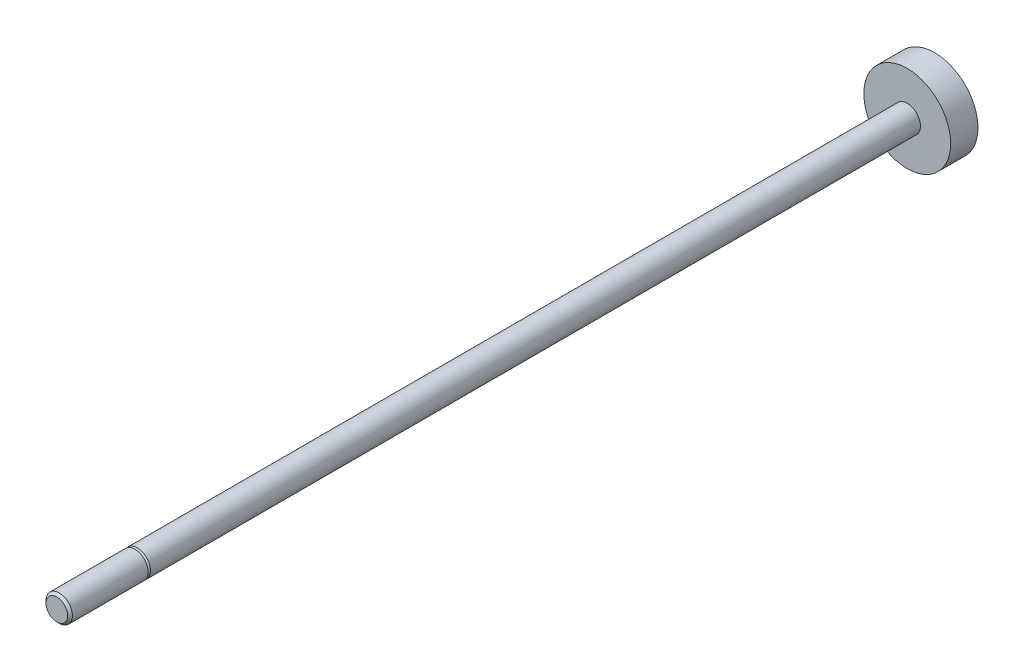
ISO-10303-21;
HEADER;
FILE_DESCRIPTION(('STEP AP214'),'2;1');
FILE_NAME('part.step','',(''),(''),'','','');
FILE_SCHEMA(('AUTOMOTIVE_DESIGN { 1 0 10303 214 1 1 1 1 }'));
ENDSEC;
DATA;
#1=APPLICATION_CONTEXT('core data for automotive mechanical design processes');
#2=APPLICATION_PROTOCOL_DEFINITION('international standard','automotive_design',2000,#1);
#3=PRODUCT_CONTEXT('',#1,'mechanical');
#4=PRODUCT('Part','Part','',(#3));
#5=PRODUCT_RELATED_PRODUCT_CATEGORY('part','',(#4));
#6=PRODUCT_DEFINITION_FORMATION('','',#4);
#7=PRODUCT_DEFINITION_CONTEXT('part definition',#1,'design');
#8=PRODUCT_DEFINITION('design','',#6,#7);
#9=PRODUCT_DEFINITION_SHAPE('','',#8);
#10=(LENGTH_UNIT() NAMED_UNIT(*) SI_UNIT(.MILLI.,.METRE.));
#11=(NAMED_UNIT(*) PLANE_ANGLE_UNIT() SI_UNIT($,.RADIAN.));
#12=(NAMED_UNIT(*) SI_UNIT($,.STERADIAN.) SOLID_ANGLE_UNIT());
#13=UNCERTAINTY_MEASURE_WITH_UNIT(LENGTH_MEASURE(1.E-05),#10,'distance_accuracy_value','');
#14=(GEOMETRIC_REPRESENTATION_CONTEXT(3) GLOBAL_UNCERTAINTY_ASSIGNED_CONTEXT((#13)) GLOBAL_UNIT_ASSIGNED_CONTEXT((#10,
#11,#12)) REPRESENTATION_CONTEXT('',''));
#15=CARTESIAN_POINT('',(0.,0.,0.));
#16=DIRECTION('',(0.,0.,1.));
#17=DIRECTION('',(1.,0.,0.));
#18=AXIS2_PLACEMENT_3D('',#15,#16,#17);
#19=CARTESIAN_POINT('',(0.,0.,25.4));
#20=DIRECTION('',(0.,0.,1.));
#21=DIRECTION('',(1.,0.,0.));
#22=AXIS2_PLACEMENT_3D('',#19,#20,#21);
#23=PLANE('',#22);
#24=CARTESIAN_POINT('',(0.,0.,25.4));
#25=DIRECTION('',(0.,0.,1.));
#26=DIRECTION('',(1.,0.,0.));
#27=AXIS2_PLACEMENT_3D('',#24,#25,#26);
#28=CIRCLE('',#27,1.9812);
#29=CARTESIAN_POINT('',(1.9812,0.,25.4));
#30=VERTEX_POINT('',#29);
#31=EDGE_CURVE('E55',#30,#30,#28,.T.);
#32=ORIENTED_EDGE('',*,*,#31,.T.);
#33=EDGE_LOOP('',(#32));
#34=FACE_BOUND('',#33,.T.);
#35=ADVANCED_FACE('F14',(#34),#23,.T.);
#36=CARTESIAN_POINT('',(0.,0.,-135.0499));
#37=DIRECTION('',(0.,0.,1.));
#38=DIRECTION('',(1.,0.,0.));
#39=AXIS2_PLACEMENT_3D('',#36,#37,#38);
#40=PLANE('',#39);
#41=CARTESIAN_POINT('',(0.,0.,-135.0499));
#42=DIRECTION('',(0.,0.,1.));
#43=DIRECTION('',(1.,0.,0.));
#44=AXIS2_PLACEMENT_3D('',#41,#42,#43);
#45=CIRCLE('',#44,7.9375);
#46=CARTESIAN_POINT('',(7.93750000000001,0.,-135.0499));
#47=VERTEX_POINT('',#46);
#48=EDGE_CURVE('E10',#47,#47,#45,.T.);
#49=ORIENTED_EDGE('',*,*,#48,.F.);
#50=EDGE_LOOP('',(#49));
#51=FACE_BOUND('',#50,.T.);
#52=ADVANCED_FACE('F76',(#51),#40,.F.);
#53=CARTESIAN_POINT('',(0.,0.,25.4));
#54=DIRECTION('',(0.,0.,1.));
#55=DIRECTION('',(1.,0.,0.));
#56=AXIS2_PLACEMENT_3D('',#53,#54,#55);
#57=CYLINDRICAL_SURFACE('',#56,7.9375);
#58=CARTESIAN_POINT('',(0.,0.,-130.0499));
#59=DIRECTION('',(0.,0.,1.));
#60=DIRECTION('',(1.,0.,0.));
#61=AXIS2_PLACEMENT_3D('',#58,#59,#60);
#62=CIRCLE('',#61,7.9375);
#63=CARTESIAN_POINT('',(7.93750000000001,0.,-130.0499));
#64=VERTEX_POINT('',#63);
#65=EDGE_CURVE('E21',#64,#64,#62,.T.);
#66=ORIENTED_EDGE('',*,*,#65,.F.);
#67=EDGE_LOOP('',(#66));
#68=FACE_BOUND('',#67,.T.);
#69=ORIENTED_EDGE('',*,*,#48,.T.);
#70=EDGE_LOOP('',(#69));
#71=FACE_BOUND('',#70,.T.);
#72=ADVANCED_FACE('F80',(#68,#71),#57,.T.);
#73=CARTESIAN_POINT('',(0.,7.9375,-130.0499));
#74=DIRECTION('',(0.,0.,-1.));
#75=DIRECTION('',(-1.,0.,0.));
#76=AXIS2_PLACEMENT_3D('',#73,#74,#75);
#77=PLANE('',#76);
#78=CARTESIAN_POINT('',(0.,0.,-130.0499));
#79=DIRECTION('',(0.,0.,1.));
#80=DIRECTION('',(1.,0.,0.));
#81=AXIS2_PLACEMENT_3D('',#78,#79,#80);
#82=CIRCLE('',#81,2.413);
#83=CARTESIAN_POINT('',(2.41300000000001,0.,-130.0499));
#84=VERTEX_POINT('',#83);
#85=EDGE_CURVE('E30',#84,#84,#82,.T.);
#86=ORIENTED_EDGE('',*,*,#85,.F.);
#87=EDGE_LOOP('',(#86));
#88=FACE_BOUND('',#87,.T.);
#89=ORIENTED_EDGE('',*,*,#65,.T.);
#90=EDGE_LOOP('',(#89));
#91=FACE_BOUND('',#90,.T.);
#92=ADVANCED_FACE('F85',(#88,#91),#77,.F.);
#93=CARTESIAN_POINT('',(0.,0.,25.4));
#94=DIRECTION('',(0.,0.,1.));
#95=DIRECTION('',(1.,0.,0.));
#96=AXIS2_PLACEMENT_3D('',#93,#94,#95);
#97=CYLINDRICAL_SURFACE('',#96,2.413);
#98=CARTESIAN_POINT('',(0.,0.,10.6934));
#99=DIRECTION('',(0.,0.,1.));
#100=DIRECTION('',(1.,0.,0.));
#101=AXIS2_PLACEMENT_3D('',#98,#99,#100);
#102=CIRCLE('',#101,2.413);
#103=CARTESIAN_POINT('',(2.413,0.,10.6934));
#104=VERTEX_POINT('',#103);
#105=EDGE_CURVE('E37',#104,#104,#102,.T.);
#106=ORIENTED_EDGE('',*,*,#105,.F.);
#107=EDGE_LOOP('',(#106));
#108=FACE_BOUND('',#107,.T.);
#109=ORIENTED_EDGE('',*,*,#85,.T.);
#110=EDGE_LOOP('',(#109));
#111=FACE_BOUND('',#110,.T.);
#112=ADVANCED_FACE('F91',(#108,#111),#97,.T.);
#113=CARTESIAN_POINT('',(0.,0.,11.1252));
#114=DIRECTION('',(0.,0.,-1.));
#115=DIRECTION('',(-1.,0.,0.));
#116=AXIS2_PLACEMENT_3D('',#113,#114,#115);
#117=CONICAL_SURFACE('',#116,1.9812,0.785398163397443);
#118=ORIENTED_EDGE('',*,*,#105,.T.);
#119=EDGE_LOOP('',(#118));
#120=FACE_BOUND('',#119,.T.);
#121=CARTESIAN_POINT('',(0.,0.,11.1252));
#122=DIRECTION('',(0.,0.,1.));
#123=DIRECTION('',(1.,0.,0.));
#124=AXIS2_PLACEMENT_3D('',#121,#122,#123);
#125=CIRCLE('',#124,1.9812);
#126=CARTESIAN_POINT('',(1.9812,0.,11.1252));
#127=VERTEX_POINT('',#126);
#128=EDGE_CURVE('E43',#127,#127,#125,.T.);
#129=ORIENTED_EDGE('',*,*,#128,.F.);
#130=EDGE_LOOP('',(#129));
#131=FACE_BOUND('',#130,.T.);
#132=ADVANCED_FACE('F95',(#120,#131),#117,.T.);
#133=CARTESIAN_POINT('',(0.,2.413,11.1252));
#134=DIRECTION('',(0.,0.,-1.));
#135=DIRECTION('',(-1.,0.,0.));
#136=AXIS2_PLACEMENT_3D('',#133,#134,#135);
#137=PLANE('',#136);
#138=ORIENTED_EDGE('',*,*,#128,.T.);
#139=EDGE_LOOP('',(#138));
#140=FACE_BOUND('',#139,.T.);
#141=CARTESIAN_POINT('',(0.,0.,11.1252));
#142=DIRECTION('',(0.,0.,1.));
#143=DIRECTION('',(1.,0.,0.));
#144=AXIS2_PLACEMENT_3D('',#141,#142,#143);
#145=CIRCLE('',#144,2.413);
#146=CARTESIAN_POINT('',(2.413,0.,11.1252));
#147=VERTEX_POINT('',#146);
#148=EDGE_CURVE('E47',#147,#147,#145,.T.);
#149=ORIENTED_EDGE('',*,*,#148,.F.);
#150=EDGE_LOOP('',(#149));
#151=FACE_BOUND('',#150,.T.);
#152=ADVANCED_FACE('F72',(#140,#151),#137,.T.);
#153=CARTESIAN_POINT('',(0.,0.,25.4));
#154=DIRECTION('',(0.,0.,1.));
#155=DIRECTION('',(1.,0.,0.));
#156=AXIS2_PLACEMENT_3D('',#153,#154,#155);
#157=CYLINDRICAL_SURFACE('',#156,2.413);
#158=ORIENTED_EDGE('',*,*,#148,.T.);
#159=EDGE_LOOP('',(#158));
#160=FACE_BOUND('',#159,.T.);
#161=CARTESIAN_POINT('',(0.,0.,24.9682));
#162=DIRECTION('',(0.,0.,1.));
#163=DIRECTION('',(1.,0.,0.));
#164=AXIS2_PLACEMENT_3D('',#161,#162,#163);
#165=CIRCLE('',#164,2.413);
#166=CARTESIAN_POINT('',(2.413,0.,24.9682));
#167=VERTEX_POINT('',#166);
#168=EDGE_CURVE('E51',#167,#167,#165,.T.);
#169=ORIENTED_EDGE('',*,*,#168,.F.);
#170=EDGE_LOOP('',(#169));
#171=FACE_BOUND('',#170,.T.);
#172=ADVANCED_FACE('F65',(#160,#171),#157,.T.);
#173=CARTESIAN_POINT('',(0.,0.,25.4));
#174=DIRECTION('',(0.,0.,-1.));
#175=DIRECTION('',(-1.,0.,0.));
#176=AXIS2_PLACEMENT_3D('',#173,#174,#175);
#177=CONICAL_SURFACE('',#176,1.9812,0.785398163397448);
#178=ORIENTED_EDGE('',*,*,#168,.T.);
#179=EDGE_LOOP('',(#178));
#180=FACE_BOUND('',#179,.T.);
#181=ORIENTED_EDGE('',*,*,#31,.F.);
#182=EDGE_LOOP('',(#181));
#183=FACE_BOUND('',#182,.T.);
#184=ADVANCED_FACE('F63',(#180,#183),#177,.T.);
#185=CLOSED_SHELL('',(#35,#52,#72,#92,#112,#132,#152,#172,#184));
#186=MANIFOLD_SOLID_BREP('B1',#185);
#187=ADVANCED_BREP_SHAPE_REPRESENTATION('',(#18,#186),#14);
#188=SHAPE_DEFINITION_REPRESENTATION(#9,#187);
ENDSEC;
END-ISO-10303-21;
